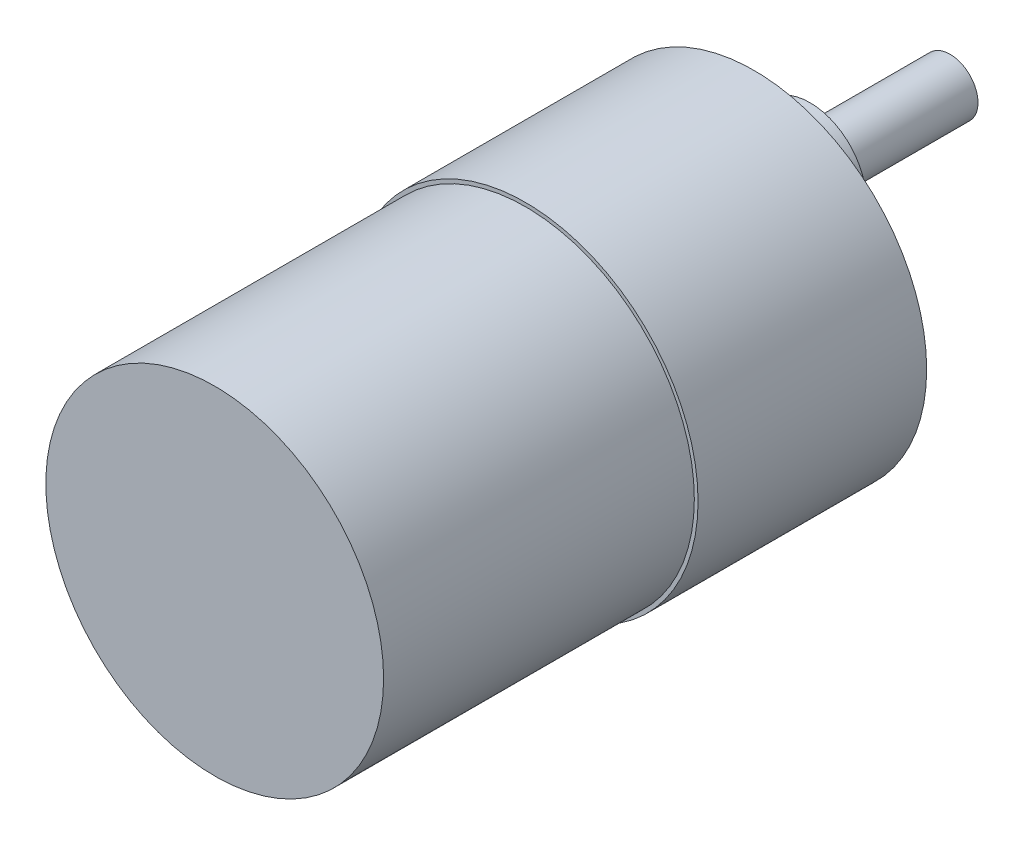
ISO-10303-21;
HEADER;
FILE_DESCRIPTION(('STEP AP214'),'2;1');
FILE_NAME('part.step','',(''),(''),'','','');
FILE_SCHEMA(('AUTOMOTIVE_DESIGN { 1 0 10303 214 1 1 1 1 }'));
ENDSEC;
DATA;
#1=APPLICATION_CONTEXT('core data for automotive mechanical design processes');
#2=APPLICATION_PROTOCOL_DEFINITION('international standard','automotive_design',2000,#1);
#3=PRODUCT_CONTEXT('',#1,'mechanical');
#4=PRODUCT('Part','Part','',(#3));
#5=PRODUCT_RELATED_PRODUCT_CATEGORY('part','',(#4));
#6=PRODUCT_DEFINITION_FORMATION('','',#4);
#7=PRODUCT_DEFINITION_CONTEXT('part definition',#1,'design');
#8=PRODUCT_DEFINITION('design','',#6,#7);
#9=PRODUCT_DEFINITION_SHAPE('','',#8);
#10=(LENGTH_UNIT() NAMED_UNIT(*) SI_UNIT(.MILLI.,.METRE.));
#11=(NAMED_UNIT(*) PLANE_ANGLE_UNIT() SI_UNIT($,.RADIAN.));
#12=(NAMED_UNIT(*) SI_UNIT($,.STERADIAN.) SOLID_ANGLE_UNIT());
#13=UNCERTAINTY_MEASURE_WITH_UNIT(LENGTH_MEASURE(1.E-05),#10,'distance_accuracy_value','');
#14=(GEOMETRIC_REPRESENTATION_CONTEXT(3) GLOBAL_UNCERTAINTY_ASSIGNED_CONTEXT((#13)) GLOBAL_UNIT_ASSIGNED_CONTEXT((#10,
#11,#12)) REPRESENTATION_CONTEXT('',''));
#15=CARTESIAN_POINT('',(0.,0.,0.));
#16=DIRECTION('',(0.,0.,1.));
#17=DIRECTION('',(1.,0.,0.));
#18=AXIS2_PLACEMENT_3D('',#15,#16,#17);
#19=CARTESIAN_POINT('',(0.,0.,24.5));
#20=DIRECTION('',(0.,0.,-1.));
#21=DIRECTION('',(-1.,0.,0.));
#22=AXIS2_PLACEMENT_3D('',#19,#20,#21);
#23=CYLINDRICAL_SURFACE('',#22,18.5);
#24=CARTESIAN_POINT('',(0.,0.,24.5));
#25=DIRECTION('',(0.,0.,1.));
#26=DIRECTION('',(1.,0.,0.));
#27=AXIS2_PLACEMENT_3D('',#24,#25,#26);
#28=CIRCLE('',#27,18.5);
#29=CARTESIAN_POINT('',(18.5,0.,24.5));
#30=VERTEX_POINT('',#29);
#31=EDGE_CURVE('E108',#30,#30,#28,.T.);
#32=ORIENTED_EDGE('',*,*,#31,.F.);
#33=EDGE_LOOP('',(#32));
#34=FACE_BOUND('',#33,.T.);
#35=CARTESIAN_POINT('',(0.,0.,0.));
#36=DIRECTION('',(0.,0.,1.));
#37=DIRECTION('',(1.,0.,0.));
#38=AXIS2_PLACEMENT_3D('',#35,#36,#37);
#39=CIRCLE('',#38,18.5);
#40=CARTESIAN_POINT('',(18.5,0.,0.));
#41=VERTEX_POINT('',#40);
#42=EDGE_CURVE('E103',#41,#41,#39,.T.);
#43=ORIENTED_EDGE('',*,*,#42,.T.);
#44=EDGE_LOOP('',(#43));
#45=FACE_BOUND('',#44,.T.);
#46=ADVANCED_FACE('F43',(#34,#45),#23,.T.);
#47=CARTESIAN_POINT('',(0.,0.,24.5));
#48=DIRECTION('',(0.,0.,1.));
#49=DIRECTION('',(1.,0.,0.));
#50=AXIS2_PLACEMENT_3D('',#47,#48,#49);
#51=PLANE('',#50);
#52=CARTESIAN_POINT('',(0.,0.,24.5));
#53=DIRECTION('',(0.,0.,1.));
#54=DIRECTION('',(1.,0.,0.));
#55=AXIS2_PLACEMENT_3D('',#52,#53,#54);
#56=CIRCLE('',#55,18.1);
#57=CARTESIAN_POINT('',(18.1,0.,24.5));
#58=VERTEX_POINT('',#57);
#59=EDGE_CURVE('E104',#58,#58,#56,.T.);
#60=ORIENTED_EDGE('',*,*,#59,.F.);
#61=EDGE_LOOP('',(#60));
#62=FACE_BOUND('',#61,.T.);
#63=ORIENTED_EDGE('',*,*,#31,.T.);
#64=EDGE_LOOP('',(#63));
#65=FACE_BOUND('',#64,.T.);
#66=ADVANCED_FACE('F121',(#62,#65),#51,.T.);
#67=CARTESIAN_POINT('',(0.,0.,0.));
#68=DIRECTION('',(0.,0.,1.));
#69=DIRECTION('',(1.,0.,0.));
#70=AXIS2_PLACEMENT_3D('',#67,#68,#69);
#71=PLANE('',#70);
#72=CARTESIAN_POINT('',(-16.,0.,0.));
#73=DIRECTION('',(0.,0.,-1.));
#74=DIRECTION('',(-1.,0.,0.));
#75=AXIS2_PLACEMENT_3D('',#72,#73,#74);
#76=CIRCLE('',#75,1.5);
#77=CARTESIAN_POINT('',(-17.5,0.,0.));
#78=VERTEX_POINT('',#77);
#79=EDGE_CURVE('E394',#78,#78,#76,.T.);
#80=ORIENTED_EDGE('',*,*,#79,.F.);
#81=EDGE_LOOP('',(#80));
#82=FACE_BOUND('',#81,.T.);
#83=CARTESIAN_POINT('',(7.99999999999987,13.8564064605511,0.));
#84=DIRECTION('',(0.,0.,-1.));
#85=DIRECTION('',(-1.,0.,0.));
#86=AXIS2_PLACEMENT_3D('',#83,#84,#85);
#87=CIRCLE('',#86,1.5);
#88=CARTESIAN_POINT('',(6.49999999999987,13.8564064605511,0.));
#89=VERTEX_POINT('',#88);
#90=EDGE_CURVE('E403',#89,#89,#87,.T.);
#91=ORIENTED_EDGE('',*,*,#90,.F.);
#92=EDGE_LOOP('',(#91));
#93=FACE_BOUND('',#92,.T.);
#94=CARTESIAN_POINT('',(8.00000000000007,-13.856406460551,0.));
#95=DIRECTION('',(0.,0.,-1.));
#96=DIRECTION('',(-1.,0.,0.));
#97=AXIS2_PLACEMENT_3D('',#94,#95,#96);
#98=CIRCLE('',#97,1.5);
#99=CARTESIAN_POINT('',(6.50000000000007,-13.856406460551,0.));
#100=VERTEX_POINT('',#99);
#101=EDGE_CURVE('E435',#100,#100,#98,.T.);
#102=ORIENTED_EDGE('',*,*,#101,.F.);
#103=EDGE_LOOP('',(#102));
#104=FACE_BOUND('',#103,.T.);
#105=CARTESIAN_POINT('',(-7.99999999999987,-13.8564064605511,0.));
#106=DIRECTION('',(0.,0.,-1.));
#107=DIRECTION('',(-1.,0.,0.));
#108=AXIS2_PLACEMENT_3D('',#105,#106,#107);
#109=CIRCLE('',#108,1.5);
#110=CARTESIAN_POINT('',(-9.49999999999987,-13.8564064605511,0.));
#111=VERTEX_POINT('',#110);
#112=EDGE_CURVE('E427',#111,#111,#109,.T.);
#113=ORIENTED_EDGE('',*,*,#112,.F.);
#114=EDGE_LOOP('',(#113));
#115=FACE_BOUND('',#114,.T.);
#116=CARTESIAN_POINT('',(-8.00000000000006,13.856406460551,0.));
#117=DIRECTION('',(0.,0.,-1.));
#118=DIRECTION('',(-1.,0.,0.));
#119=AXIS2_PLACEMENT_3D('',#116,#117,#118);
#120=CIRCLE('',#119,1.5);
#121=CARTESIAN_POINT('',(-9.50000000000007,13.856406460551,0.));
#122=VERTEX_POINT('',#121);
#123=EDGE_CURVE('E419',#122,#122,#120,.T.);
#124=ORIENTED_EDGE('',*,*,#123,.F.);
#125=EDGE_LOOP('',(#124));
#126=FACE_BOUND('',#125,.T.);
#127=CARTESIAN_POINT('',(16.,0.,0.));
#128=DIRECTION('',(0.,0.,-1.));
#129=DIRECTION('',(-1.,0.,0.));
#130=AXIS2_PLACEMENT_3D('',#127,#128,#129);
#131=CIRCLE('',#130,1.5);
#132=CARTESIAN_POINT('',(14.5,0.,0.));
#133=VERTEX_POINT('',#132);
#134=EDGE_CURVE('E400',#133,#133,#131,.T.);
#135=ORIENTED_EDGE('',*,*,#134,.F.);
#136=EDGE_LOOP('',(#135));
#137=FACE_BOUND('',#136,.T.);
#138=CARTESIAN_POINT('',(0.,6.5,0.));
#139=DIRECTION('',(0.,0.,1.));
#140=DIRECTION('',(1.,0.,0.));
#141=AXIS2_PLACEMENT_3D('',#138,#139,#140);
#142=CIRCLE('',#141,6.);
#143=CARTESIAN_POINT('',(6.,6.5,0.));
#144=VERTEX_POINT('',#143);
#145=EDGE_CURVE('E46',#144,#144,#142,.F.);
#146=ORIENTED_EDGE('',*,*,#145,.F.);
#147=EDGE_LOOP('',(#146));
#148=FACE_BOUND('',#147,.T.);
#149=ORIENTED_EDGE('',*,*,#42,.F.);
#150=EDGE_LOOP('',(#149));
#151=FACE_BOUND('',#150,.T.);
#152=ADVANCED_FACE('F118',(#82,#93,#104,#115,#126,#137,#148,#151),#71,.F.);
#153=CARTESIAN_POINT('',(0.,0.,57.8));
#154=DIRECTION('',(0.,0.,-1.));
#155=DIRECTION('',(-1.,0.,0.));
#156=AXIS2_PLACEMENT_3D('',#153,#154,#155);
#157=CYLINDRICAL_SURFACE('',#156,18.1);
#158=CARTESIAN_POINT('',(0.,0.,57.8));
#159=DIRECTION('',(0.,0.,1.));
#160=DIRECTION('',(1.,0.,0.));
#161=AXIS2_PLACEMENT_3D('',#158,#159,#160);
#162=CIRCLE('',#161,18.1);
#163=CARTESIAN_POINT('',(18.1,0.,57.8));
#164=VERTEX_POINT('',#163);
#165=EDGE_CURVE('E96',#164,#164,#162,.T.);
#166=ORIENTED_EDGE('',*,*,#165,.F.);
#167=EDGE_LOOP('',(#166));
#168=FACE_BOUND('',#167,.T.);
#169=ORIENTED_EDGE('',*,*,#59,.T.);
#170=EDGE_LOOP('',(#169));
#171=FACE_BOUND('',#170,.T.);
#172=ADVANCED_FACE('F120',(#168,#171),#157,.T.);
#173=CARTESIAN_POINT('',(0.,0.,57.8));
#174=DIRECTION('',(0.,0.,1.));
#175=DIRECTION('',(1.,0.,0.));
#176=AXIS2_PLACEMENT_3D('',#173,#174,#175);
#177=PLANE('',#176);
#178=ORIENTED_EDGE('',*,*,#165,.T.);
#179=EDGE_LOOP('',(#178));
#180=FACE_BOUND('',#179,.T.);
#181=ADVANCED_FACE('F127',(#180),#177,.T.);
#182=CARTESIAN_POINT('',(0.,6.5,-6.));
#183=DIRECTION('',(0.,0.,1.));
#184=DIRECTION('',(1.,0.,0.));
#185=AXIS2_PLACEMENT_3D('',#182,#183,#184);
#186=CYLINDRICAL_SURFACE('',#185,6.);
#187=CARTESIAN_POINT('',(0.,6.5,-6.));
#188=DIRECTION('',(0.,0.,-1.));
#189=DIRECTION('',(-1.,0.,0.));
#190=AXIS2_PLACEMENT_3D('',#187,#188,#189);
#191=CIRCLE('',#190,6.);
#192=CARTESIAN_POINT('',(-6.,6.5,-6.));
#193=VERTEX_POINT('',#192);
#194=EDGE_CURVE('E90',#193,#193,#191,.T.);
#195=ORIENTED_EDGE('',*,*,#194,.F.);
#196=EDGE_LOOP('',(#195));
#197=FACE_BOUND('',#196,.T.);
#198=ORIENTED_EDGE('',*,*,#145,.T.);
#199=EDGE_LOOP('',(#198));
#200=FACE_BOUND('',#199,.T.);
#201=ADVANCED_FACE('F165',(#197,#200),#186,.T.);
#202=CARTESIAN_POINT('',(0.,6.5,-6.));
#203=DIRECTION('',(0.,0.,-1.));
#204=DIRECTION('',(-1.,0.,0.));
#205=AXIS2_PLACEMENT_3D('',#202,#203,#204);
#206=PLANE('',#205);
#207=CARTESIAN_POINT('',(0.,6.5,-6.));
#208=DIRECTION('',(0.,0.,-1.));
#209=DIRECTION('',(-1.,0.,0.));
#210=AXIS2_PLACEMENT_3D('',#207,#208,#209);
#211=CIRCLE('',#210,3.);
#212=CARTESIAN_POINT('',(-3.,6.5,-6.));
#213=VERTEX_POINT('',#212);
#214=EDGE_CURVE('E11',#213,#213,#211,.T.);
#215=ORIENTED_EDGE('',*,*,#214,.F.);
#216=EDGE_LOOP('',(#215));
#217=FACE_BOUND('',#216,.T.);
#218=ORIENTED_EDGE('',*,*,#194,.T.);
#219=EDGE_LOOP('',(#218));
#220=FACE_BOUND('',#219,.T.);
#221=ADVANCED_FACE('F175',(#217,#220),#206,.T.);
#222=CARTESIAN_POINT('',(0.,6.5,-21.));
#223=DIRECTION('',(0.,0.,1.));
#224=DIRECTION('',(1.,0.,0.));
#225=AXIS2_PLACEMENT_3D('',#222,#223,#224);
#226=CYLINDRICAL_SURFACE('',#225,3.);
#227=CARTESIAN_POINT('',(0.,6.5,-21.));
#228=DIRECTION('',(0.,0.,-1.));
#229=DIRECTION('',(-1.,0.,0.));
#230=AXIS2_PLACEMENT_3D('',#227,#228,#229);
#231=CIRCLE('',#230,3.);
#232=CARTESIAN_POINT('',(-2.75,7.69895788082819,-21.));
#233=VERTEX_POINT('',#232);
#234=CARTESIAN_POINT('',(-2.75,5.30104211917182,-21.));
#235=VERTEX_POINT('',#234);
#236=EDGE_CURVE('E85',#233,#235,#231,.T.);
#237=ORIENTED_EDGE('',*,*,#236,.F.);
#238=DIRECTION('',(0.,0.,-1.));
#239=VECTOR('',#238,1.);
#240=CARTESIAN_POINT('',(-2.75,7.69895788082818,-9.));
#241=LINE('',#240,#239);
#242=CARTESIAN_POINT('',(-2.75,7.69895788082818,-9.));
#243=VERTEX_POINT('',#242);
#244=EDGE_CURVE('E59',#243,#233,#241,.T.);
#245=ORIENTED_EDGE('',*,*,#244,.F.);
#246=CARTESIAN_POINT('',(0.,6.5,-9.));
#247=DIRECTION('',(0.,0.,-1.));
#248=DIRECTION('',(-1.,0.,0.));
#249=AXIS2_PLACEMENT_3D('',#246,#247,#248);
#250=CIRCLE('',#249,3.);
#251=CARTESIAN_POINT('',(-2.75,5.30104211917182,-9.));
#252=VERTEX_POINT('',#251);
#253=EDGE_CURVE('E79',#252,#243,#250,.T.);
#254=ORIENTED_EDGE('',*,*,#253,.F.);
#255=DIRECTION('',(0.,0.,-1.));
#256=VECTOR('',#255,1.);
#257=CARTESIAN_POINT('',(-2.75,5.30104211917182,-9.));
#258=LINE('',#257,#256);
#259=EDGE_CURVE('E73',#252,#235,#258,.T.);
#260=ORIENTED_EDGE('',*,*,#259,.T.);
#261=EDGE_LOOP('',(#237,#245,#254,#260));
#262=FACE_BOUND('',#261,.T.);
#263=ORIENTED_EDGE('',*,*,#214,.T.);
#264=EDGE_LOOP('',(#263));
#265=FACE_BOUND('',#264,.T.);
#266=ADVANCED_FACE('F83',(#262,#265),#226,.T.);
#267=CARTESIAN_POINT('',(0.,6.5,-21.));
#268=DIRECTION('',(0.,0.,-1.));
#269=DIRECTION('',(-1.,0.,0.));
#270=AXIS2_PLACEMENT_3D('',#267,#268,#269);
#271=PLANE('',#270);
#272=DIRECTION('',(0.,-1.,0.));
#273=VECTOR('',#272,1.);
#274=CARTESIAN_POINT('',(-2.75,6.5,-21.));
#275=LINE('',#274,#273);
#276=EDGE_CURVE('E70',#233,#235,#275,.T.);
#277=ORIENTED_EDGE('',*,*,#276,.F.);
#278=ORIENTED_EDGE('',*,*,#236,.T.);
#279=EDGE_LOOP('',(#277,#278));
#280=FACE_BOUND('',#279,.T.);
#281=ADVANCED_FACE('F88',(#280),#271,.T.);
#282=CARTESIAN_POINT('',(-2.75,6.5,-9.));
#283=DIRECTION('',(1.,0.,0.));
#284=DIRECTION('',(0.,0.,-1.));
#285=AXIS2_PLACEMENT_3D('',#282,#283,#284);
#286=PLANE('',#285);
#287=ORIENTED_EDGE('',*,*,#276,.T.);
#288=ORIENTED_EDGE('',*,*,#259,.F.);
#289=DIRECTION('',(0.,-1.,0.));
#290=VECTOR('',#289,1.);
#291=CARTESIAN_POINT('',(-2.75,6.5,-9.));
#292=LINE('',#291,#290);
#293=EDGE_CURVE('E66',#243,#252,#292,.T.);
#294=ORIENTED_EDGE('',*,*,#293,.F.);
#295=ORIENTED_EDGE('',*,*,#244,.T.);
#296=EDGE_LOOP('',(#287,#288,#294,#295));
#297=FACE_BOUND('',#296,.T.);
#298=ADVANCED_FACE('F72',(#297),#286,.F.);
#299=CARTESIAN_POINT('',(0.,6.5,-9.));
#300=DIRECTION('',(0.,0.,-1.));
#301=DIRECTION('',(-1.,0.,0.));
#302=AXIS2_PLACEMENT_3D('',#299,#300,#301);
#303=PLANE('',#302);
#304=ORIENTED_EDGE('',*,*,#253,.T.);
#305=ORIENTED_EDGE('',*,*,#293,.T.);
#306=EDGE_LOOP('',(#304,#305));
#307=FACE_BOUND('',#306,.T.);
#308=ADVANCED_FACE('F210',(#307),#303,.T.);
#309=CARTESIAN_POINT('',(16.,0.,3.));
#310=DIRECTION('',(0.,0.,-1.));
#311=DIRECTION('',(-1.,0.,0.));
#312=AXIS2_PLACEMENT_3D('',#309,#310,#311);
#313=CYLINDRICAL_SURFACE('',#312,1.5);
#314=CARTESIAN_POINT('',(16.,0.,3.));
#315=DIRECTION('',(0.,0.,-1.));
#316=DIRECTION('',(-1.,0.,0.));
#317=AXIS2_PLACEMENT_3D('',#314,#315,#316);
#318=CIRCLE('',#317,1.5);
#319=CARTESIAN_POINT('',(14.5,0.,3.));
#320=VERTEX_POINT('',#319);
#321=EDGE_CURVE('E415',#320,#320,#318,.T.);
#322=ORIENTED_EDGE('',*,*,#321,.F.);
#323=EDGE_LOOP('',(#322));
#324=FACE_BOUND('',#323,.T.);
#325=ORIENTED_EDGE('',*,*,#134,.T.);
#326=EDGE_LOOP('',(#325));
#327=FACE_BOUND('',#326,.T.);
#328=ADVANCED_FACE('F218',(#324,#327),#313,.F.);
#329=CARTESIAN_POINT('',(16.,0.,3.));
#330=DIRECTION('',(0.,0.,-1.));
#331=DIRECTION('',(-1.,0.,0.));
#332=AXIS2_PLACEMENT_3D('',#329,#330,#331);
#333=PLANE('',#332);
#334=ORIENTED_EDGE('',*,*,#321,.T.);
#335=EDGE_LOOP('',(#334));
#336=FACE_BOUND('',#335,.T.);
#337=ADVANCED_FACE('F226',(#336),#333,.T.);
#338=CARTESIAN_POINT('',(-8.00000000000006,13.856406460551,3.));
#339=DIRECTION('',(0.,0.,-1.));
#340=DIRECTION('',(-1.,0.,0.));
#341=AXIS2_PLACEMENT_3D('',#338,#339,#340);
#342=CYLINDRICAL_SURFACE('',#341,1.5);
#343=CARTESIAN_POINT('',(-8.00000000000006,13.856406460551,3.));
#344=DIRECTION('',(0.,0.,-1.));
#345=DIRECTION('',(-1.,0.,0.));
#346=AXIS2_PLACEMENT_3D('',#343,#344,#345);
#347=CIRCLE('',#346,1.5);
#348=CARTESIAN_POINT('',(-9.50000000000007,13.856406460551,3.));
#349=VERTEX_POINT('',#348);
#350=EDGE_CURVE('E423',#349,#349,#347,.T.);
#351=ORIENTED_EDGE('',*,*,#350,.F.);
#352=EDGE_LOOP('',(#351));
#353=FACE_BOUND('',#352,.T.);
#354=ORIENTED_EDGE('',*,*,#123,.T.);
#355=EDGE_LOOP('',(#354));
#356=FACE_BOUND('',#355,.T.);
#357=ADVANCED_FACE('F236',(#353,#356),#342,.F.);
#358=CARTESIAN_POINT('',(-8.00000000000006,13.856406460551,3.));
#359=DIRECTION('',(0.,0.,-1.));
#360=DIRECTION('',(-1.,0.,0.));
#361=AXIS2_PLACEMENT_3D('',#358,#359,#360);
#362=PLANE('',#361);
#363=ORIENTED_EDGE('',*,*,#350,.T.);
#364=EDGE_LOOP('',(#363));
#365=FACE_BOUND('',#364,.T.);
#366=ADVANCED_FACE('F246',(#365),#362,.T.);
#367=CARTESIAN_POINT('',(-7.99999999999987,-13.8564064605511,3.));
#368=DIRECTION('',(0.,0.,-1.));
#369=DIRECTION('',(-1.,0.,0.));
#370=AXIS2_PLACEMENT_3D('',#367,#368,#369);
#371=CYLINDRICAL_SURFACE('',#370,1.5);
#372=CARTESIAN_POINT('',(-7.99999999999987,-13.8564064605511,3.));
#373=DIRECTION('',(0.,0.,-1.));
#374=DIRECTION('',(-1.,0.,0.));
#375=AXIS2_PLACEMENT_3D('',#372,#373,#374);
#376=CIRCLE('',#375,1.5);
#377=CARTESIAN_POINT('',(-9.49999999999987,-13.8564064605511,3.));
#378=VERTEX_POINT('',#377);
#379=EDGE_CURVE('E431',#378,#378,#376,.T.);
#380=ORIENTED_EDGE('',*,*,#379,.F.);
#381=EDGE_LOOP('',(#380));
#382=FACE_BOUND('',#381,.T.);
#383=ORIENTED_EDGE('',*,*,#112,.T.);
#384=EDGE_LOOP('',(#383));
#385=FACE_BOUND('',#384,.T.);
#386=ADVANCED_FACE('F256',(#382,#385),#371,.F.);
#387=CARTESIAN_POINT('',(-7.99999999999987,-13.8564064605511,3.));
#388=DIRECTION('',(0.,0.,-1.));
#389=DIRECTION('',(-1.,0.,0.));
#390=AXIS2_PLACEMENT_3D('',#387,#388,#389);
#391=PLANE('',#390);
#392=ORIENTED_EDGE('',*,*,#379,.T.);
#393=EDGE_LOOP('',(#392));
#394=FACE_BOUND('',#393,.T.);
#395=ADVANCED_FACE('F266',(#394),#391,.T.);
#396=CARTESIAN_POINT('',(8.00000000000007,-13.856406460551,3.));
#397=DIRECTION('',(0.,0.,-1.));
#398=DIRECTION('',(-1.,0.,0.));
#399=AXIS2_PLACEMENT_3D('',#396,#397,#398);
#400=CYLINDRICAL_SURFACE('',#399,1.5);
#401=CARTESIAN_POINT('',(8.00000000000007,-13.856406460551,3.));
#402=DIRECTION('',(0.,0.,-1.));
#403=DIRECTION('',(-1.,0.,0.));
#404=AXIS2_PLACEMENT_3D('',#401,#402,#403);
#405=CIRCLE('',#404,1.5);
#406=CARTESIAN_POINT('',(6.50000000000007,-13.856406460551,3.));
#407=VERTEX_POINT('',#406);
#408=EDGE_CURVE('E407',#407,#407,#405,.T.);
#409=ORIENTED_EDGE('',*,*,#408,.F.);
#410=EDGE_LOOP('',(#409));
#411=FACE_BOUND('',#410,.T.);
#412=ORIENTED_EDGE('',*,*,#101,.T.);
#413=EDGE_LOOP('',(#412));
#414=FACE_BOUND('',#413,.T.);
#415=ADVANCED_FACE('F276',(#411,#414),#400,.F.);
#416=CARTESIAN_POINT('',(8.00000000000007,-13.856406460551,3.));
#417=DIRECTION('',(0.,0.,-1.));
#418=DIRECTION('',(-1.,0.,0.));
#419=AXIS2_PLACEMENT_3D('',#416,#417,#418);
#420=PLANE('',#419);
#421=ORIENTED_EDGE('',*,*,#408,.T.);
#422=EDGE_LOOP('',(#421));
#423=FACE_BOUND('',#422,.T.);
#424=ADVANCED_FACE('F286',(#423),#420,.T.);
#425=CARTESIAN_POINT('',(7.99999999999987,13.8564064605511,3.));
#426=DIRECTION('',(0.,0.,-1.));
#427=DIRECTION('',(-1.,0.,0.));
#428=AXIS2_PLACEMENT_3D('',#425,#426,#427);
#429=CYLINDRICAL_SURFACE('',#428,1.5);
#430=CARTESIAN_POINT('',(7.99999999999987,13.8564064605511,3.));
#431=DIRECTION('',(0.,0.,-1.));
#432=DIRECTION('',(-1.,0.,0.));
#433=AXIS2_PLACEMENT_3D('',#430,#431,#432);
#434=CIRCLE('',#433,1.5);
#435=CARTESIAN_POINT('',(6.49999999999987,13.8564064605511,3.));
#436=VERTEX_POINT('',#435);
#437=EDGE_CURVE('E408',#436,#436,#434,.T.);
#438=ORIENTED_EDGE('',*,*,#437,.F.);
#439=EDGE_LOOP('',(#438));
#440=FACE_BOUND('',#439,.T.);
#441=ORIENTED_EDGE('',*,*,#90,.T.);
#442=EDGE_LOOP('',(#441));
#443=FACE_BOUND('',#442,.T.);
#444=ADVANCED_FACE('F296',(#440,#443),#429,.F.);
#445=CARTESIAN_POINT('',(7.99999999999987,13.8564064605511,3.));
#446=DIRECTION('',(0.,0.,-1.));
#447=DIRECTION('',(-1.,0.,0.));
#448=AXIS2_PLACEMENT_3D('',#445,#446,#447);
#449=PLANE('',#448);
#450=ORIENTED_EDGE('',*,*,#437,.T.);
#451=EDGE_LOOP('',(#450));
#452=FACE_BOUND('',#451,.T.);
#453=ADVANCED_FACE('F306',(#452),#449,.T.);
#454=CARTESIAN_POINT('',(-16.,0.,3.));
#455=DIRECTION('',(0.,0.,-1.));
#456=DIRECTION('',(-1.,0.,0.));
#457=AXIS2_PLACEMENT_3D('',#454,#455,#456);
#458=CYLINDRICAL_SURFACE('',#457,1.5);
#459=CARTESIAN_POINT('',(-16.,0.,3.));
#460=DIRECTION('',(0.,0.,-1.));
#461=DIRECTION('',(-1.,0.,0.));
#462=AXIS2_PLACEMENT_3D('',#459,#460,#461);
#463=CIRCLE('',#462,1.5);
#464=CARTESIAN_POINT('',(-17.5,0.,3.));
#465=VERTEX_POINT('',#464);
#466=EDGE_CURVE('E80',#465,#465,#463,.T.);
#467=ORIENTED_EDGE('',*,*,#466,.F.);
#468=EDGE_LOOP('',(#467));
#469=FACE_BOUND('',#468,.T.);
#470=ORIENTED_EDGE('',*,*,#79,.T.);
#471=EDGE_LOOP('',(#470));
#472=FACE_BOUND('',#471,.T.);
#473=ADVANCED_FACE('F316',(#469,#472),#458,.F.);
#474=CARTESIAN_POINT('',(-16.,0.,3.));
#475=DIRECTION('',(0.,0.,-1.));
#476=DIRECTION('',(-1.,0.,0.));
#477=AXIS2_PLACEMENT_3D('',#474,#475,#476);
#478=PLANE('',#477);
#479=ORIENTED_EDGE('',*,*,#466,.T.);
#480=EDGE_LOOP('',(#479));
#481=FACE_BOUND('',#480,.T.);
#482=ADVANCED_FACE('F326',(#481),#478,.T.);
#483=CLOSED_SHELL('',(#46,#66,#152,#172,#181,#201,#221,#266,#281,#298,#308,#328,#337,#357,#366,
#386,#395,#415,#424,#444,#453,#473,#482));
#484=MANIFOLD_SOLID_BREP('B2',#483);
#485=ADVANCED_BREP_SHAPE_REPRESENTATION('',(#18,#484),#14);
#486=SHAPE_DEFINITION_REPRESENTATION(#9,#485);
ENDSEC;
END-ISO-10303-21;
